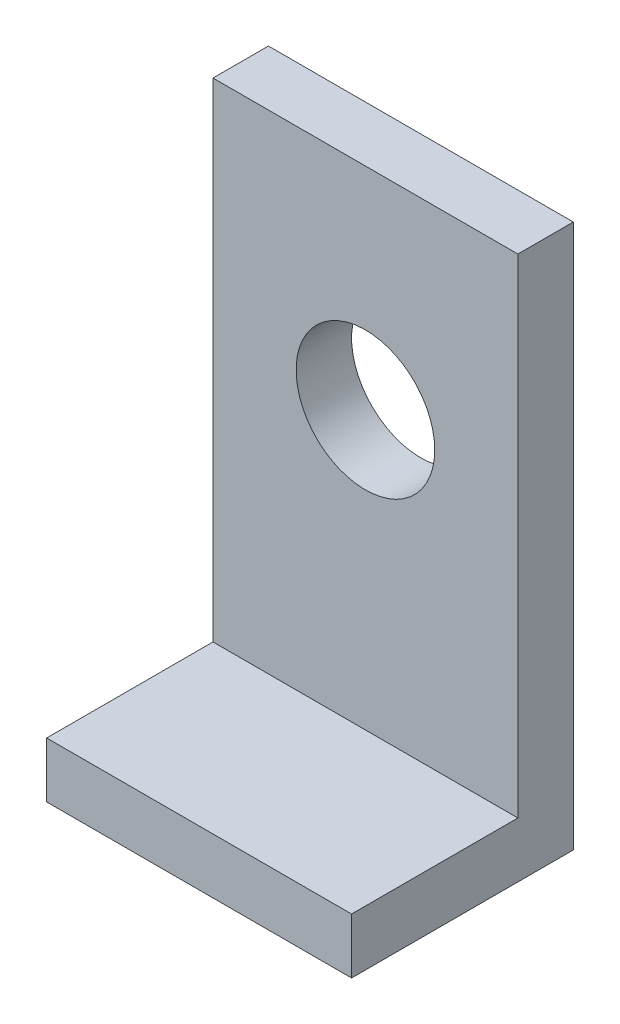
ISO-10303-21;
HEADER;
FILE_DESCRIPTION(('STEP AP214'),'2;1');
FILE_NAME('part.step','',(''),(''),'','','');
FILE_SCHEMA(('AUTOMOTIVE_DESIGN { 1 0 10303 214 1 1 1 1 }'));
ENDSEC;
DATA;
#1=APPLICATION_CONTEXT('core data for automotive mechanical design processes');
#2=APPLICATION_PROTOCOL_DEFINITION('international standard','automotive_design',2000,#1);
#3=PRODUCT_CONTEXT('',#1,'mechanical');
#4=PRODUCT('Part','Part','',(#3));
#5=PRODUCT_RELATED_PRODUCT_CATEGORY('part','',(#4));
#6=PRODUCT_DEFINITION_FORMATION('','',#4);
#7=PRODUCT_DEFINITION_CONTEXT('part definition',#1,'design');
#8=PRODUCT_DEFINITION('design','',#6,#7);
#9=PRODUCT_DEFINITION_SHAPE('','',#8);
#10=(LENGTH_UNIT() NAMED_UNIT(*) SI_UNIT(.MILLI.,.METRE.));
#11=(NAMED_UNIT(*) PLANE_ANGLE_UNIT() SI_UNIT($,.RADIAN.));
#12=(NAMED_UNIT(*) SI_UNIT($,.STERADIAN.) SOLID_ANGLE_UNIT());
#13=UNCERTAINTY_MEASURE_WITH_UNIT(LENGTH_MEASURE(1.E-05),#10,'distance_accuracy_value','');
#14=(GEOMETRIC_REPRESENTATION_CONTEXT(3) GLOBAL_UNCERTAINTY_ASSIGNED_CONTEXT((#13)) GLOBAL_UNIT_ASSIGNED_CONTEXT((#10,
#11,#12)) REPRESENTATION_CONTEXT('',''));
#15=CARTESIAN_POINT('',(0.,0.,0.));
#16=DIRECTION('',(0.,0.,1.));
#17=DIRECTION('',(1.,0.,0.));
#18=AXIS2_PLACEMENT_3D('',#15,#16,#17);
#19=CARTESIAN_POINT('',(0.,0.,10.));
#20=DIRECTION('',(0.,0.,-1.));
#21=DIRECTION('',(-1.,0.,0.));
#22=AXIS2_PLACEMENT_3D('',#19,#20,#21);
#23=PLANE('',#22);
#24=CARTESIAN_POINT('',(0.,60.,10.));
#25=DIRECTION('',(0.,0.,1.));
#26=DIRECTION('',(1.,0.,0.));
#27=AXIS2_PLACEMENT_3D('',#24,#25,#26);
#28=CIRCLE('',#27,12.5);
#29=CARTESIAN_POINT('',(12.5,60.,10.));
#30=VERTEX_POINT('',#29);
#31=EDGE_CURVE('E117',#30,#30,#28,.T.);
#32=ORIENTED_EDGE('',*,*,#31,.F.);
#33=EDGE_LOOP('',(#32));
#34=FACE_BOUND('',#33,.T.);
#35=DIRECTION('',(-1.,0.,0.));
#36=VECTOR('',#35,1.);
#37=CARTESIAN_POINT('',(-27.5,9.99999999999999,10.));
#38=LINE('',#37,#36);
#39=CARTESIAN_POINT('',(27.5,9.99999999999999,10.));
#40=VERTEX_POINT('',#39);
#41=CARTESIAN_POINT('',(-27.5,9.99999999999999,10.));
#42=VERTEX_POINT('',#41);
#43=EDGE_CURVE('E54',#40,#42,#38,.T.);
#44=ORIENTED_EDGE('',*,*,#43,.F.);
#45=DIRECTION('',(0.,1.,0.));
#46=VECTOR('',#45,1.);
#47=CARTESIAN_POINT('',(27.5,98.1,10.));
#48=LINE('',#47,#46);
#49=CARTESIAN_POINT('',(27.5,98.1,10.));
#50=VERTEX_POINT('',#49);
#51=EDGE_CURVE('E59',#40,#50,#48,.T.);
#52=ORIENTED_EDGE('',*,*,#51,.T.);
#53=DIRECTION('',(-1.,0.,0.));
#54=VECTOR('',#53,1.);
#55=CARTESIAN_POINT('',(-27.5,98.1,10.));
#56=LINE('',#55,#54);
#57=CARTESIAN_POINT('',(-27.5,98.1,10.));
#58=VERTEX_POINT('',#57);
#59=EDGE_CURVE('E97',#50,#58,#56,.T.);
#60=ORIENTED_EDGE('',*,*,#59,.T.);
#61=DIRECTION('',(0.,-1.,0.));
#62=VECTOR('',#61,1.);
#63=CARTESIAN_POINT('',(-27.5,0.,10.));
#64=LINE('',#63,#62);
#65=EDGE_CURVE('E103',#58,#42,#64,.T.);
#66=ORIENTED_EDGE('',*,*,#65,.T.);
#67=EDGE_LOOP('',(#44,#52,#60,#66));
#68=FACE_BOUND('',#67,.T.);
#69=ADVANCED_FACE('F39',(#34,#68),#23,.F.);
#70=CARTESIAN_POINT('',(0.,0.,0.));
#71=DIRECTION('',(0.,0.,-1.));
#72=DIRECTION('',(-1.,0.,0.));
#73=AXIS2_PLACEMENT_3D('',#70,#71,#72);
#74=PLANE('',#73);
#75=DIRECTION('',(0.,-1.,0.));
#76=VECTOR('',#75,1.);
#77=CARTESIAN_POINT('',(-27.5,0.,0.));
#78=LINE('',#77,#76);
#79=CARTESIAN_POINT('',(-27.5,98.1,0.));
#80=VERTEX_POINT('',#79);
#81=CARTESIAN_POINT('',(-27.5,0.,0.));
#82=VERTEX_POINT('',#81);
#83=EDGE_CURVE('E101',#80,#82,#78,.T.);
#84=ORIENTED_EDGE('',*,*,#83,.F.);
#85=DIRECTION('',(-1.,0.,0.));
#86=VECTOR('',#85,1.);
#87=CARTESIAN_POINT('',(0.,98.1,0.));
#88=LINE('',#87,#86);
#89=CARTESIAN_POINT('',(27.5,98.1,0.));
#90=VERTEX_POINT('',#89);
#91=EDGE_CURVE('E90',#90,#80,#88,.T.);
#92=ORIENTED_EDGE('',*,*,#91,.F.);
#93=DIRECTION('',(0.,1.,0.));
#94=VECTOR('',#93,1.);
#95=CARTESIAN_POINT('',(27.5,98.1,0.));
#96=LINE('',#95,#94);
#97=CARTESIAN_POINT('',(27.5,0.,0.));
#98=VERTEX_POINT('',#97);
#99=EDGE_CURVE('E80',#98,#90,#96,.T.);
#100=ORIENTED_EDGE('',*,*,#99,.F.);
#101=DIRECTION('',(1.,0.,0.));
#102=VECTOR('',#101,1.);
#103=CARTESIAN_POINT('',(27.5,0.,0.));
#104=LINE('',#103,#102);
#105=EDGE_CURVE('E91',#82,#98,#104,.T.);
#106=ORIENTED_EDGE('',*,*,#105,.F.);
#107=EDGE_LOOP('',(#84,#92,#100,#106));
#108=FACE_BOUND('',#107,.T.);
#109=CARTESIAN_POINT('',(0.,60.,0.));
#110=DIRECTION('',(0.,0.,1.));
#111=DIRECTION('',(1.,0.,0.));
#112=AXIS2_PLACEMENT_3D('',#109,#110,#111);
#113=CIRCLE('',#112,12.5);
#114=CARTESIAN_POINT('',(12.5,60.,0.));
#115=VERTEX_POINT('',#114);
#116=EDGE_CURVE('E122',#115,#115,#113,.T.);
#117=ORIENTED_EDGE('',*,*,#116,.T.);
#118=EDGE_LOOP('',(#117));
#119=FACE_BOUND('',#118,.T.);
#120=ADVANCED_FACE('F99',(#108,#119),#74,.T.);
#121=CARTESIAN_POINT('',(-27.5,0.,10.));
#122=DIRECTION('',(1.,0.,0.));
#123=DIRECTION('',(0.,1.,0.));
#124=AXIS2_PLACEMENT_3D('',#121,#122,#123);
#125=PLANE('',#124);
#126=ORIENTED_EDGE('',*,*,#83,.T.);
#127=DIRECTION('',(0.,0.,-1.));
#128=VECTOR('',#127,1.);
#129=CARTESIAN_POINT('',(-27.5,0.,10.));
#130=LINE('',#129,#128);
#131=CARTESIAN_POINT('',(-27.5,0.,40.));
#132=VERTEX_POINT('',#131);
#133=EDGE_CURVE('E47',#132,#82,#130,.T.);
#134=ORIENTED_EDGE('',*,*,#133,.F.);
#135=DIRECTION('',(0.,-1.,0.));
#136=VECTOR('',#135,1.);
#137=CARTESIAN_POINT('',(-27.5,0.,40.));
#138=LINE('',#137,#136);
#139=CARTESIAN_POINT('',(-27.5,9.99999999999999,40.));
#140=VERTEX_POINT('',#139);
#141=EDGE_CURVE('E133',#140,#132,#138,.T.);
#142=ORIENTED_EDGE('',*,*,#141,.F.);
#143=DIRECTION('',(0.,0.,-1.));
#144=VECTOR('',#143,1.);
#145=CARTESIAN_POINT('',(-27.5,9.99999999999999,40.));
#146=LINE('',#145,#144);
#147=EDGE_CURVE('E130',#140,#42,#146,.T.);
#148=ORIENTED_EDGE('',*,*,#147,.T.);
#149=ORIENTED_EDGE('',*,*,#65,.F.);
#150=DIRECTION('',(0.,0.,-1.));
#151=VECTOR('',#150,1.);
#152=CARTESIAN_POINT('',(-27.5,98.1,10.));
#153=LINE('',#152,#151);
#154=EDGE_CURVE('E11',#58,#80,#153,.T.);
#155=ORIENTED_EDGE('',*,*,#154,.T.);
#156=EDGE_LOOP('',(#126,#134,#142,#148,#149,#155));
#157=FACE_BOUND('',#156,.T.);
#158=ADVANCED_FACE('F41',(#157),#125,.F.);
#159=CARTESIAN_POINT('',(27.5,0.,10.));
#160=DIRECTION('',(0.,1.,0.));
#161=DIRECTION('',(-1.,0.,0.));
#162=AXIS2_PLACEMENT_3D('',#159,#160,#161);
#163=PLANE('',#162);
#164=ORIENTED_EDGE('',*,*,#105,.T.);
#165=DIRECTION('',(0.,0.,-1.));
#166=VECTOR('',#165,1.);
#167=CARTESIAN_POINT('',(27.5,0.,10.));
#168=LINE('',#167,#166);
#169=CARTESIAN_POINT('',(27.5,0.,40.));
#170=VERTEX_POINT('',#169);
#171=EDGE_CURVE('E86',#170,#98,#168,.T.);
#172=ORIENTED_EDGE('',*,*,#171,.F.);
#173=DIRECTION('',(1.,0.,0.));
#174=VECTOR('',#173,1.);
#175=CARTESIAN_POINT('',(27.5,0.,40.));
#176=LINE('',#175,#174);
#177=EDGE_CURVE('E113',#132,#170,#176,.T.);
#178=ORIENTED_EDGE('',*,*,#177,.F.);
#179=ORIENTED_EDGE('',*,*,#133,.T.);
#180=EDGE_LOOP('',(#164,#172,#178,#179));
#181=FACE_BOUND('',#180,.T.);
#182=ADVANCED_FACE('F111',(#181),#163,.F.);
#183=CARTESIAN_POINT('',(27.5,98.1,10.));
#184=DIRECTION('',(-1.,0.,0.));
#185=DIRECTION('',(0.,-1.,0.));
#186=AXIS2_PLACEMENT_3D('',#183,#184,#185);
#187=PLANE('',#186);
#188=ORIENTED_EDGE('',*,*,#99,.T.);
#189=DIRECTION('',(0.,0.,-1.));
#190=VECTOR('',#189,1.);
#191=CARTESIAN_POINT('',(27.5,98.1,10.));
#192=LINE('',#191,#190);
#193=EDGE_CURVE('E83',#50,#90,#192,.T.);
#194=ORIENTED_EDGE('',*,*,#193,.F.);
#195=ORIENTED_EDGE('',*,*,#51,.F.);
#196=DIRECTION('',(0.,0.,-1.));
#197=VECTOR('',#196,1.);
#198=CARTESIAN_POINT('',(27.5,9.99999999999999,40.));
#199=LINE('',#198,#197);
#200=CARTESIAN_POINT('',(27.5,9.99999999999999,40.));
#201=VERTEX_POINT('',#200);
#202=EDGE_CURVE('E125',#201,#40,#199,.T.);
#203=ORIENTED_EDGE('',*,*,#202,.F.);
#204=DIRECTION('',(0.,1.,0.));
#205=VECTOR('',#204,1.);
#206=CARTESIAN_POINT('',(27.5,9.99999999999999,40.));
#207=LINE('',#206,#205);
#208=EDGE_CURVE('E139',#170,#201,#207,.T.);
#209=ORIENTED_EDGE('',*,*,#208,.F.);
#210=ORIENTED_EDGE('',*,*,#171,.T.);
#211=EDGE_LOOP('',(#188,#194,#195,#203,#209,#210));
#212=FACE_BOUND('',#211,.T.);
#213=ADVANCED_FACE('F82',(#212),#187,.F.);
#214=CARTESIAN_POINT('',(0.,98.1,10.));
#215=DIRECTION('',(0.,-1.,0.));
#216=DIRECTION('',(0.,0.,-1.));
#217=AXIS2_PLACEMENT_3D('',#214,#215,#216);
#218=PLANE('',#217);
#219=ORIENTED_EDGE('',*,*,#91,.T.);
#220=ORIENTED_EDGE('',*,*,#154,.F.);
#221=ORIENTED_EDGE('',*,*,#59,.F.);
#222=ORIENTED_EDGE('',*,*,#193,.T.);
#223=EDGE_LOOP('',(#219,#220,#221,#222));
#224=FACE_BOUND('',#223,.T.);
#225=ADVANCED_FACE('F94',(#224),#218,.F.);
#226=CARTESIAN_POINT('',(0.,60.,10.));
#227=DIRECTION('',(0.,0.,-1.));
#228=DIRECTION('',(-1.,0.,0.));
#229=AXIS2_PLACEMENT_3D('',#226,#227,#228);
#230=CYLINDRICAL_SURFACE('',#229,12.5);
#231=ORIENTED_EDGE('',*,*,#31,.T.);
#232=EDGE_LOOP('',(#231));
#233=FACE_BOUND('',#232,.T.);
#234=ORIENTED_EDGE('',*,*,#116,.F.);
#235=EDGE_LOOP('',(#234));
#236=FACE_BOUND('',#235,.T.);
#237=ADVANCED_FACE('F171',(#233,#236),#230,.F.);
#238=CARTESIAN_POINT('',(-27.5,9.99999999999999,40.));
#239=DIRECTION('',(0.,-1.,0.));
#240=DIRECTION('',(1.,0.,0.));
#241=AXIS2_PLACEMENT_3D('',#238,#239,#240);
#242=PLANE('',#241);
#243=ORIENTED_EDGE('',*,*,#43,.T.);
#244=ORIENTED_EDGE('',*,*,#147,.F.);
#245=DIRECTION('',(-1.,0.,0.));
#246=VECTOR('',#245,1.);
#247=CARTESIAN_POINT('',(-27.5,9.99999999999999,40.));
#248=LINE('',#247,#246);
#249=EDGE_CURVE('E136',#201,#140,#248,.T.);
#250=ORIENTED_EDGE('',*,*,#249,.F.);
#251=ORIENTED_EDGE('',*,*,#202,.T.);
#252=EDGE_LOOP('',(#243,#244,#250,#251));
#253=FACE_BOUND('',#252,.T.);
#254=ADVANCED_FACE('F156',(#253),#242,.F.);
#255=CARTESIAN_POINT('',(0.,0.,40.));
#256=DIRECTION('',(0.,0.,-1.));
#257=DIRECTION('',(-1.,0.,0.));
#258=AXIS2_PLACEMENT_3D('',#255,#256,#257);
#259=PLANE('',#258);
#260=ORIENTED_EDGE('',*,*,#177,.T.);
#261=ORIENTED_EDGE('',*,*,#208,.T.);
#262=ORIENTED_EDGE('',*,*,#249,.T.);
#263=ORIENTED_EDGE('',*,*,#141,.T.);
#264=EDGE_LOOP('',(#260,#261,#262,#263));
#265=FACE_BOUND('',#264,.T.);
#266=ADVANCED_FACE('F144',(#265),#259,.F.);
#267=CLOSED_SHELL('',(#69,#120,#158,#182,#213,#225,#237,#254,#266));
#268=MANIFOLD_SOLID_BREP('B2',#267);
#269=ADVANCED_BREP_SHAPE_REPRESENTATION('',(#18,#268),#14);
#270=SHAPE_DEFINITION_REPRESENTATION(#9,#269);
ENDSEC;
END-ISO-10303-21;
